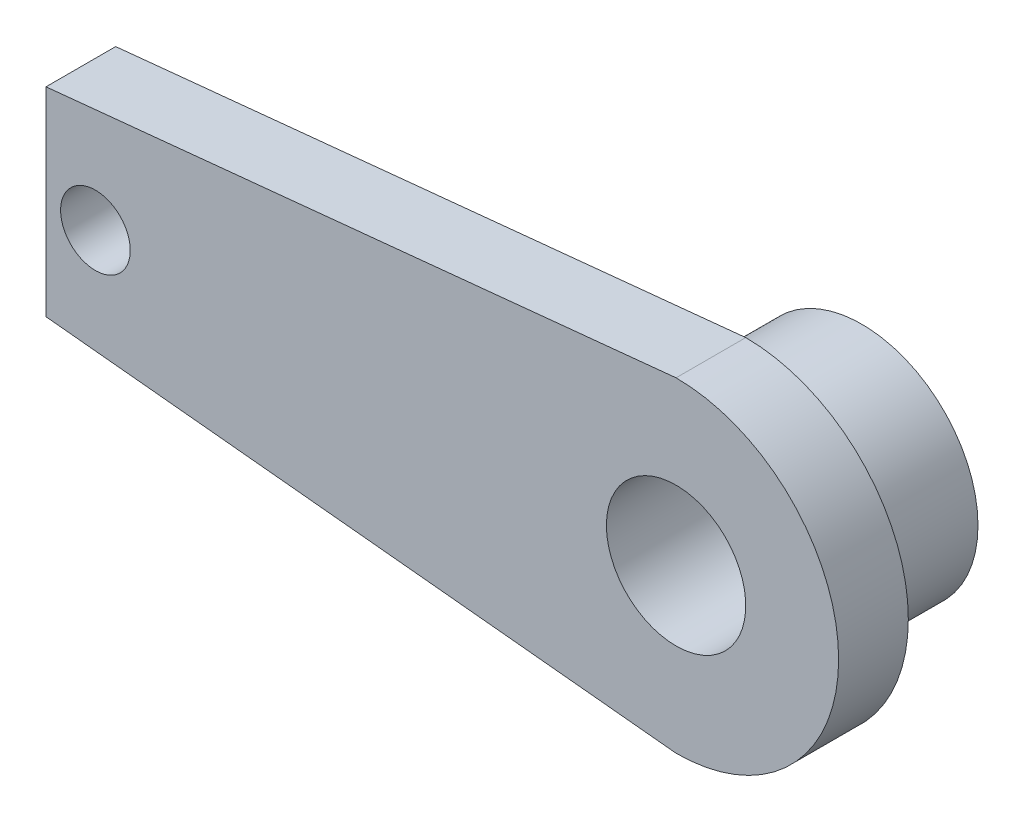
ISO-10303-21;
HEADER;
FILE_DESCRIPTION(('STEP AP214'),'2;1');
FILE_NAME('part.step','',(''),(''),'','','');
FILE_SCHEMA(('AUTOMOTIVE_DESIGN { 1 0 10303 214 1 1 1 1 }'));
ENDSEC;
DATA;
#1=APPLICATION_CONTEXT('core data for automotive mechanical design processes');
#2=APPLICATION_PROTOCOL_DEFINITION('international standard','automotive_design',2000,#1);
#3=PRODUCT_CONTEXT('',#1,'mechanical');
#4=PRODUCT('Part','Part','',(#3));
#5=PRODUCT_RELATED_PRODUCT_CATEGORY('part','',(#4));
#6=PRODUCT_DEFINITION_FORMATION('','',#4);
#7=PRODUCT_DEFINITION_CONTEXT('part definition',#1,'design');
#8=PRODUCT_DEFINITION('design','',#6,#7);
#9=PRODUCT_DEFINITION_SHAPE('','',#8);
#10=(LENGTH_UNIT() NAMED_UNIT(*) SI_UNIT(.MILLI.,.METRE.));
#11=(NAMED_UNIT(*) PLANE_ANGLE_UNIT() SI_UNIT($,.RADIAN.));
#12=(NAMED_UNIT(*) SI_UNIT($,.STERADIAN.) SOLID_ANGLE_UNIT());
#13=UNCERTAINTY_MEASURE_WITH_UNIT(LENGTH_MEASURE(1.E-05),#10,'distance_accuracy_value','');
#14=(GEOMETRIC_REPRESENTATION_CONTEXT(3) GLOBAL_UNCERTAINTY_ASSIGNED_CONTEXT((#13)) GLOBAL_UNIT_ASSIGNED_CONTEXT((#10,
#11,#12)) REPRESENTATION_CONTEXT('',''));
#15=CARTESIAN_POINT('',(0.,0.,0.));
#16=DIRECTION('',(0.,0.,1.));
#17=DIRECTION('',(1.,0.,0.));
#18=AXIS2_PLACEMENT_3D('',#15,#16,#17);
#19=CARTESIAN_POINT('',(-30.,-4.,8.));
#20=DIRECTION('',(0.099503719020999,0.995037190209989,0.));
#21=DIRECTION('',(-0.995037190209989,0.099503719020999,0.));
#22=AXIS2_PLACEMENT_3D('',#19,#20,#21);
#23=PLANE('',#22);
#24=DIRECTION('',(0.,0.,-1.));
#25=VECTOR('',#24,1.);
#26=CARTESIAN_POINT('',(-27.1280270584127,-4.28719729415873,15.));
#27=LINE('',#26,#25);
#28=CARTESIAN_POINT('',(-27.1280270584127,-4.28719729415873,8.));
#29=VERTEX_POINT('',#28);
#30=CARTESIAN_POINT('',(-27.1280270584127,-4.28719729415873,5.));
#31=VERTEX_POINT('',#30);
#32=EDGE_CURVE('E156',#29,#31,#27,.T.);
#33=ORIENTED_EDGE('',*,*,#32,.T.);
#34=DIRECTION('',(0.995037190209989,-0.0995037190209989,0.));
#35=VECTOR('',#34,1.);
#36=CARTESIAN_POINT('',(-30.,-4.,5.));
#37=LINE('',#36,#35);
#38=CARTESIAN_POINT('',(0.,-7.,5.));
#39=VERTEX_POINT('',#38);
#40=EDGE_CURVE('E85',#31,#39,#37,.T.);
#41=ORIENTED_EDGE('',*,*,#40,.T.);
#42=DIRECTION('',(0.,0.,-1.));
#43=VECTOR('',#42,1.);
#44=CARTESIAN_POINT('',(0.,-7.,8.));
#45=LINE('',#44,#43);
#46=CARTESIAN_POINT('',(0.,-7.,8.));
#47=VERTEX_POINT('',#46);
#48=EDGE_CURVE('E80',#47,#39,#45,.T.);
#49=ORIENTED_EDGE('',*,*,#48,.F.);
#50=DIRECTION('',(0.995037190209989,-0.0995037190209989,0.));
#51=VECTOR('',#50,1.);
#52=CARTESIAN_POINT('',(-30.,-4.,8.));
#53=LINE('',#52,#51);
#54=EDGE_CURVE('E94',#29,#47,#53,.T.);
#55=ORIENTED_EDGE('',*,*,#54,.F.);
#56=EDGE_LOOP('',(#33,#41,#49,#55));
#57=FACE_BOUND('',#56,.T.);
#58=ADVANCED_FACE('F37',(#57),#23,.F.);
#59=CARTESIAN_POINT('',(-30.,4.,8.));
#60=DIRECTION('',(0.099503719020999,-0.995037190209989,0.));
#61=DIRECTION('',(0.995037190209989,0.099503719020999,0.));
#62=AXIS2_PLACEMENT_3D('',#59,#60,#61);
#63=PLANE('',#62);
#64=DIRECTION('',(0.,0.,-1.));
#65=VECTOR('',#64,1.);
#66=CARTESIAN_POINT('',(-27.1280270584127,4.28719729415873,15.));
#67=LINE('',#66,#65);
#68=CARTESIAN_POINT('',(-27.1280270584127,4.28719729415873,8.));
#69=VERTEX_POINT('',#68);
#70=CARTESIAN_POINT('',(-27.1280270584127,4.28719729415873,5.));
#71=VERTEX_POINT('',#70);
#72=EDGE_CURVE('E52',#69,#71,#67,.T.);
#73=ORIENTED_EDGE('',*,*,#72,.F.);
#74=DIRECTION('',(-0.995037190209989,-0.0995037190209989,0.));
#75=VECTOR('',#74,1.);
#76=CARTESIAN_POINT('',(-30.,4.,8.));
#77=LINE('',#76,#75);
#78=CARTESIAN_POINT('',(0.,7.,8.));
#79=VERTEX_POINT('',#78);
#80=EDGE_CURVE('E90',#79,#69,#77,.T.);
#81=ORIENTED_EDGE('',*,*,#80,.F.);
#82=DIRECTION('',(0.,0.,-1.));
#83=VECTOR('',#82,1.);
#84=CARTESIAN_POINT('',(0.,7.,8.));
#85=LINE('',#84,#83);
#86=CARTESIAN_POINT('',(0.,7.,5.));
#87=VERTEX_POINT('',#86);
#88=EDGE_CURVE('E77',#79,#87,#85,.T.);
#89=ORIENTED_EDGE('',*,*,#88,.T.);
#90=DIRECTION('',(-0.995037190209989,-0.0995037190209989,0.));
#91=VECTOR('',#90,1.);
#92=CARTESIAN_POINT('',(-30.,4.,5.));
#93=LINE('',#92,#91);
#94=EDGE_CURVE('E84',#87,#71,#93,.T.);
#95=ORIENTED_EDGE('',*,*,#94,.T.);
#96=EDGE_LOOP('',(#73,#81,#89,#95));
#97=FACE_BOUND('',#96,.T.);
#98=ADVANCED_FACE('F89',(#97),#63,.F.);
#99=CARTESIAN_POINT('',(-30.,0.,8.));
#100=DIRECTION('',(0.,0.,1.));
#101=DIRECTION('',(1.,0.,0.));
#102=AXIS2_PLACEMENT_3D('',#99,#100,#101);
#103=PLANE('',#102);
#104=CARTESIAN_POINT('',(0.,0.,8.));
#105=DIRECTION('',(0.,0.,-1.));
#106=DIRECTION('',(-1.,0.,0.));
#107=AXIS2_PLACEMENT_3D('',#104,#105,#106);
#108=CIRCLE('',#107,3.);
#109=CARTESIAN_POINT('',(-3.,0.,8.));
#110=VERTEX_POINT('',#109);
#111=EDGE_CURVE('E138',#110,#110,#108,.T.);
#112=ORIENTED_EDGE('',*,*,#111,.T.);
#113=EDGE_LOOP('',(#112));
#114=FACE_BOUND('',#113,.T.);
#115=CARTESIAN_POINT('',(-25.,0.,8.));
#116=DIRECTION('',(0.,0.,-1.));
#117=DIRECTION('',(-1.,0.,0.));
#118=AXIS2_PLACEMENT_3D('',#115,#116,#117);
#119=CIRCLE('',#118,1.5);
#120=CARTESIAN_POINT('',(-26.5,0.,8.));
#121=VERTEX_POINT('',#120);
#122=EDGE_CURVE('E144',#121,#121,#119,.T.);
#123=ORIENTED_EDGE('',*,*,#122,.T.);
#124=EDGE_LOOP('',(#123));
#125=FACE_BOUND('',#124,.T.);
#126=ORIENTED_EDGE('',*,*,#80,.T.);
#127=DIRECTION('',(0.,-1.,0.));
#128=VECTOR('',#127,1.);
#129=CARTESIAN_POINT('',(-27.1280270584127,0.,8.));
#130=LINE('',#129,#128);
#131=EDGE_CURVE('E141',#69,#29,#130,.T.);
#132=ORIENTED_EDGE('',*,*,#131,.T.);
#133=ORIENTED_EDGE('',*,*,#54,.T.);
#134=CARTESIAN_POINT('',(0.,0.,8.));
#135=DIRECTION('',(0.,0.,1.));
#136=DIRECTION('',(1.,0.,0.));
#137=AXIS2_PLACEMENT_3D('',#134,#135,#136);
#138=CIRCLE('',#137,7.);
#139=EDGE_CURVE('E61',#47,#79,#138,.T.);
#140=ORIENTED_EDGE('',*,*,#139,.T.);
#141=EDGE_LOOP('',(#126,#132,#133,#140));
#142=FACE_BOUND('',#141,.T.);
#143=ADVANCED_FACE('F116',(#114,#125,#142),#103,.T.);
#144=CARTESIAN_POINT('',(-30.,0.,5.));
#145=DIRECTION('',(0.,0.,1.));
#146=DIRECTION('',(1.,0.,0.));
#147=AXIS2_PLACEMENT_3D('',#144,#145,#146);
#148=PLANE('',#147);
#149=CARTESIAN_POINT('',(0.,0.,5.));
#150=DIRECTION('',(0.,0.,1.));
#151=DIRECTION('',(1.,0.,0.));
#152=AXIS2_PLACEMENT_3D('',#149,#150,#151);
#153=CIRCLE('',#152,5.);
#154=CARTESIAN_POINT('',(5.,0.,5.));
#155=VERTEX_POINT('',#154);
#156=EDGE_CURVE('E11',#155,#155,#153,.T.);
#157=ORIENTED_EDGE('',*,*,#156,.T.);
#158=EDGE_LOOP('',(#157));
#159=FACE_BOUND('',#158,.T.);
#160=CARTESIAN_POINT('',(-25.,0.,5.));
#161=DIRECTION('',(0.,0.,-1.));
#162=DIRECTION('',(-1.,0.,0.));
#163=AXIS2_PLACEMENT_3D('',#160,#161,#162);
#164=CIRCLE('',#163,1.5);
#165=CARTESIAN_POINT('',(-26.5,0.,5.));
#166=VERTEX_POINT('',#165);
#167=EDGE_CURVE('E140',#166,#166,#164,.T.);
#168=ORIENTED_EDGE('',*,*,#167,.F.);
#169=EDGE_LOOP('',(#168));
#170=FACE_BOUND('',#169,.T.);
#171=DIRECTION('',(0.,1.,0.));
#172=VECTOR('',#171,1.);
#173=CARTESIAN_POINT('',(-27.1280270584127,0.,5.));
#174=LINE('',#173,#172);
#175=EDGE_CURVE('E93',#31,#71,#174,.T.);
#176=ORIENTED_EDGE('',*,*,#175,.T.);
#177=ORIENTED_EDGE('',*,*,#94,.F.);
#178=CARTESIAN_POINT('',(0.,0.,5.));
#179=DIRECTION('',(0.,0.,1.));
#180=DIRECTION('',(1.,0.,0.));
#181=AXIS2_PLACEMENT_3D('',#178,#179,#180);
#182=CIRCLE('',#181,7.);
#183=EDGE_CURVE('E74',#39,#87,#182,.T.);
#184=ORIENTED_EDGE('',*,*,#183,.F.);
#185=ORIENTED_EDGE('',*,*,#40,.F.);
#186=EDGE_LOOP('',(#176,#177,#184,#185));
#187=FACE_BOUND('',#186,.T.);
#188=ADVANCED_FACE('F92',(#159,#170,#187),#148,.F.);
#189=CARTESIAN_POINT('',(0.,0.,0.));
#190=DIRECTION('',(0.,0.,1.));
#191=DIRECTION('',(1.,0.,0.));
#192=AXIS2_PLACEMENT_3D('',#189,#190,#191);
#193=PLANE('',#192);
#194=CARTESIAN_POINT('',(0.,0.,0.));
#195=DIRECTION('',(0.,0.,1.));
#196=DIRECTION('',(1.,0.,0.));
#197=AXIS2_PLACEMENT_3D('',#194,#195,#196);
#198=CIRCLE('',#197,5.);
#199=CARTESIAN_POINT('',(5.,0.,0.));
#200=VERTEX_POINT('',#199);
#201=EDGE_CURVE('E41',#200,#200,#198,.T.);
#202=ORIENTED_EDGE('',*,*,#201,.F.);
#203=EDGE_LOOP('',(#202));
#204=FACE_BOUND('',#203,.T.);
#205=CARTESIAN_POINT('',(0.,0.,0.));
#206=DIRECTION('',(0.,0.,1.));
#207=DIRECTION('',(1.,0.,0.));
#208=AXIS2_PLACEMENT_3D('',#205,#206,#207);
#209=CIRCLE('',#208,3.);
#210=CARTESIAN_POINT('',(3.,0.,0.));
#211=VERTEX_POINT('',#210);
#212=EDGE_CURVE('E100',#211,#211,#209,.T.);
#213=ORIENTED_EDGE('',*,*,#212,.T.);
#214=EDGE_LOOP('',(#213));
#215=FACE_BOUND('',#214,.T.);
#216=ADVANCED_FACE('F108',(#204,#215),#193,.F.);
#217=CARTESIAN_POINT('',(0.,0.,5.));
#218=DIRECTION('',(0.,0.,-1.));
#219=DIRECTION('',(-1.,0.,0.));
#220=AXIS2_PLACEMENT_3D('',#217,#218,#219);
#221=CYLINDRICAL_SURFACE('',#220,5.);
#222=ORIENTED_EDGE('',*,*,#156,.F.);
#223=EDGE_LOOP('',(#222));
#224=FACE_BOUND('',#223,.T.);
#225=ORIENTED_EDGE('',*,*,#201,.T.);
#226=EDGE_LOOP('',(#225));
#227=FACE_BOUND('',#226,.T.);
#228=ADVANCED_FACE('F39',(#224,#227),#221,.T.);
#229=CARTESIAN_POINT('',(0.,0.,5.));
#230=DIRECTION('',(0.,0.,-1.));
#231=DIRECTION('',(-1.,0.,0.));
#232=AXIS2_PLACEMENT_3D('',#229,#230,#231);
#233=CYLINDRICAL_SURFACE('',#232,3.);
#234=ORIENTED_EDGE('',*,*,#212,.F.);
#235=EDGE_LOOP('',(#234));
#236=FACE_BOUND('',#235,.T.);
#237=ORIENTED_EDGE('',*,*,#111,.F.);
#238=EDGE_LOOP('',(#237));
#239=FACE_BOUND('',#238,.T.);
#240=ADVANCED_FACE('F114',(#236,#239),#233,.F.);
#241=CARTESIAN_POINT('',(0.,0.,8.));
#242=DIRECTION('',(0.,0.,-1.));
#243=DIRECTION('',(-1.,0.,0.));
#244=AXIS2_PLACEMENT_3D('',#241,#242,#243);
#245=CYLINDRICAL_SURFACE('',#244,7.);
#246=ORIENTED_EDGE('',*,*,#183,.T.);
#247=ORIENTED_EDGE('',*,*,#88,.F.);
#248=ORIENTED_EDGE('',*,*,#139,.F.);
#249=ORIENTED_EDGE('',*,*,#48,.T.);
#250=EDGE_LOOP('',(#246,#247,#248,#249));
#251=FACE_BOUND('',#250,.T.);
#252=ADVANCED_FACE('F76',(#251),#245,.T.);
#253=CARTESIAN_POINT('',(-25.,0.,8.));
#254=DIRECTION('',(0.,0.,-1.));
#255=DIRECTION('',(-1.,0.,0.));
#256=AXIS2_PLACEMENT_3D('',#253,#254,#255);
#257=CYLINDRICAL_SURFACE('',#256,1.5);
#258=ORIENTED_EDGE('',*,*,#122,.F.);
#259=EDGE_LOOP('',(#258));
#260=FACE_BOUND('',#259,.T.);
#261=ORIENTED_EDGE('',*,*,#167,.T.);
#262=EDGE_LOOP('',(#261));
#263=FACE_BOUND('',#262,.T.);
#264=ADVANCED_FACE('F134',(#260,#263),#257,.F.);
#265=CARTESIAN_POINT('',(-27.1280270584127,0.,15.));
#266=DIRECTION('',(-1.,0.,0.));
#267=DIRECTION('',(0.,0.,1.));
#268=AXIS2_PLACEMENT_3D('',#265,#266,#267);
#269=PLANE('',#268);
#270=ORIENTED_EDGE('',*,*,#72,.T.);
#271=ORIENTED_EDGE('',*,*,#175,.F.);
#272=ORIENTED_EDGE('',*,*,#32,.F.);
#273=ORIENTED_EDGE('',*,*,#131,.F.);
#274=EDGE_LOOP('',(#270,#271,#272,#273));
#275=FACE_BOUND('',#274,.T.);
#276=ADVANCED_FACE('F160',(#275),#269,.T.);
#277=CLOSED_SHELL('',(#58,#98,#143,#188,#216,#228,#240,#252,#264,#276));
#278=MANIFOLD_SOLID_BREP('B2',#277);
#279=ADVANCED_BREP_SHAPE_REPRESENTATION('',(#18,#278),#14);
#280=SHAPE_DEFINITION_REPRESENTATION(#9,#279);
ENDSEC;
END-ISO-10303-21;
